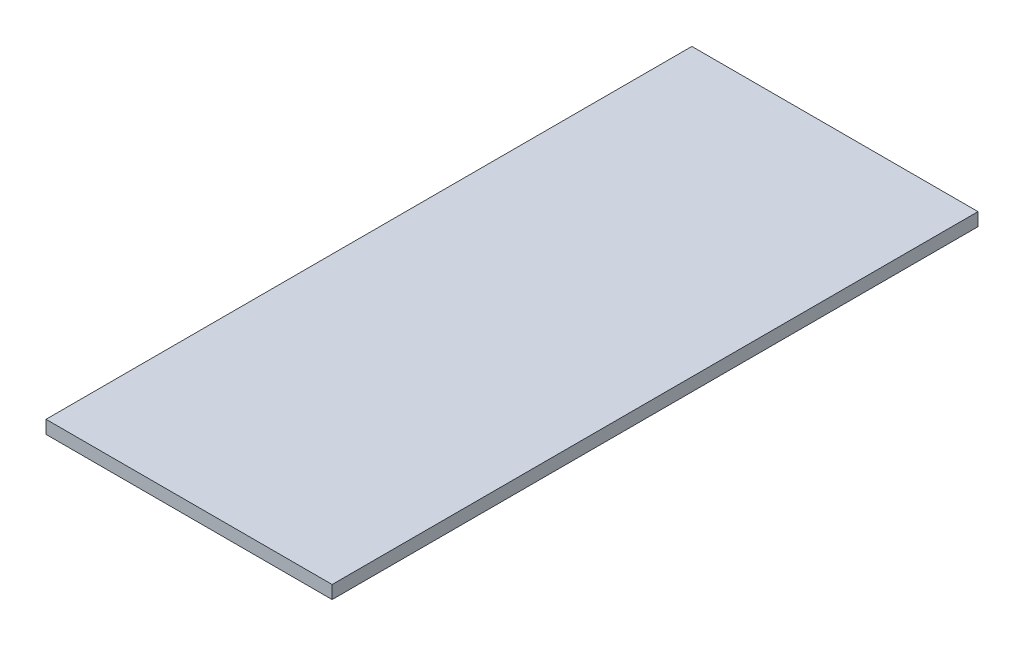
ISO-10303-21;
HEADER;
FILE_DESCRIPTION(('STEP AP214'),'2;1');
FILE_NAME('part.step','',(''),(''),'','','');
FILE_SCHEMA(('AUTOMOTIVE_DESIGN { 1 0 10303 214 1 1 1 1 }'));
ENDSEC;
DATA;
#1=APPLICATION_CONTEXT('core data for automotive mechanical design processes');
#2=APPLICATION_PROTOCOL_DEFINITION('international standard','automotive_design',2000,#1);
#3=PRODUCT_CONTEXT('',#1,'mechanical');
#4=PRODUCT('Part','Part','',(#3));
#5=PRODUCT_RELATED_PRODUCT_CATEGORY('part','',(#4));
#6=PRODUCT_DEFINITION_FORMATION('','',#4);
#7=PRODUCT_DEFINITION_CONTEXT('part definition',#1,'design');
#8=PRODUCT_DEFINITION('design','',#6,#7);
#9=PRODUCT_DEFINITION_SHAPE('','',#8);
#10=(LENGTH_UNIT() NAMED_UNIT(*) SI_UNIT(.MILLI.,.METRE.));
#11=(NAMED_UNIT(*) PLANE_ANGLE_UNIT() SI_UNIT($,.RADIAN.));
#12=(NAMED_UNIT(*) SI_UNIT($,.STERADIAN.) SOLID_ANGLE_UNIT());
#13=UNCERTAINTY_MEASURE_WITH_UNIT(LENGTH_MEASURE(1.E-05),#10,'distance_accuracy_value','');
#14=(GEOMETRIC_REPRESENTATION_CONTEXT(3) GLOBAL_UNCERTAINTY_ASSIGNED_CONTEXT((#13)) GLOBAL_UNIT_ASSIGNED_CONTEXT((#10,
#11,#12)) REPRESENTATION_CONTEXT('',''));
#15=CARTESIAN_POINT('',(0.,0.,0.));
#16=DIRECTION('',(0.,0.,1.));
#17=DIRECTION('',(1.,0.,0.));
#18=AXIS2_PLACEMENT_3D('',#15,#16,#17);
#19=CARTESIAN_POINT('',(2.25000000000002,4.82945135414424,70.8633494652552));
#20=DIRECTION('',(-1.,0.,0.));
#21=DIRECTION('',(0.,-1.,0.));
#22=AXIS2_PLACEMENT_3D('',#19,#20,#21);
#23=PLANE('',#22);
#24=DIRECTION('',(0.,0.,-1.));
#25=VECTOR('',#24,1.);
#26=CARTESIAN_POINT('',(2.25000000000002,4.02945135414424,70.8633494652552));
#27=LINE('',#26,#25);
#28=CARTESIAN_POINT('',(2.25000000000002,4.02945135414424,70.8633494652552));
#29=VERTEX_POINT('',#28);
#30=CARTESIAN_POINT('',(2.25000000000002,4.02945135414423,31.3633494652552));
#31=VERTEX_POINT('',#30);
#32=EDGE_CURVE('E102',#29,#31,#27,.T.);
#33=ORIENTED_EDGE('',*,*,#32,.T.);
#34=DIRECTION('',(0.,-1.,0.));
#35=VECTOR('',#34,1.);
#36=CARTESIAN_POINT('',(2.25000000000002,4.82945135414423,31.3633494652552));
#37=LINE('',#36,#35);
#38=CARTESIAN_POINT('',(2.25000000000002,4.82945135414423,31.3633494652552));
#39=VERTEX_POINT('',#38);
#40=EDGE_CURVE('E11',#39,#31,#37,.T.);
#41=ORIENTED_EDGE('',*,*,#40,.F.);
#42=DIRECTION('',(0.,0.,-1.));
#43=VECTOR('',#42,1.);
#44=CARTESIAN_POINT('',(2.25000000000002,4.82945135414424,70.8633494652552));
#45=LINE('',#44,#43);
#46=CARTESIAN_POINT('',(2.25000000000002,4.82945135414424,70.8633494652552));
#47=VERTEX_POINT('',#46);
#48=EDGE_CURVE('E90',#47,#39,#45,.T.);
#49=ORIENTED_EDGE('',*,*,#48,.F.);
#50=DIRECTION('',(0.,-1.,0.));
#51=VECTOR('',#50,1.);
#52=CARTESIAN_POINT('',(2.25000000000002,4.82945135414424,70.8633494652552));
#53=LINE('',#52,#51);
#54=EDGE_CURVE('E98',#47,#29,#53,.T.);
#55=ORIENTED_EDGE('',*,*,#54,.T.);
#56=EDGE_LOOP('',(#33,#41,#49,#55));
#57=FACE_BOUND('',#56,.T.);
#58=ADVANCED_FACE('F39',(#57),#23,.F.);
#59=CARTESIAN_POINT('',(2.25000000000002,4.82945135414423,31.3633494652552));
#60=DIRECTION('',(0.,0.,1.));
#61=DIRECTION('',(0.,-1.,0.));
#62=AXIS2_PLACEMENT_3D('',#59,#60,#61);
#63=PLANE('',#62);
#64=DIRECTION('',(-1.,0.,0.));
#65=VECTOR('',#64,1.);
#66=CARTESIAN_POINT('',(2.25000000000002,4.02945135414423,31.3633494652552));
#67=LINE('',#66,#65);
#68=CARTESIAN_POINT('',(-15.25,4.02945135414423,31.3633494652552));
#69=VERTEX_POINT('',#68);
#70=EDGE_CURVE('E94',#31,#69,#67,.T.);
#71=ORIENTED_EDGE('',*,*,#70,.T.);
#72=DIRECTION('',(0.,-1.,0.));
#73=VECTOR('',#72,1.);
#74=CARTESIAN_POINT('',(-15.25,4.82945135414423,31.3633494652552));
#75=LINE('',#74,#73);
#76=CARTESIAN_POINT('',(-15.25,4.82945135414423,31.3633494652552));
#77=VERTEX_POINT('',#76);
#78=EDGE_CURVE('E47',#77,#69,#75,.T.);
#79=ORIENTED_EDGE('',*,*,#78,.F.);
#80=DIRECTION('',(-1.,0.,0.));
#81=VECTOR('',#80,1.);
#82=CARTESIAN_POINT('',(2.25000000000002,4.82945135414423,31.3633494652552));
#83=LINE('',#82,#81);
#84=EDGE_CURVE('E85',#39,#77,#83,.T.);
#85=ORIENTED_EDGE('',*,*,#84,.F.);
#86=ORIENTED_EDGE('',*,*,#40,.T.);
#87=EDGE_LOOP('',(#71,#79,#85,#86));
#88=FACE_BOUND('',#87,.T.);
#89=ADVANCED_FACE('F93',(#88),#63,.F.);
#90=CARTESIAN_POINT('',(-15.25,4.82945135414424,70.8633494652552));
#91=DIRECTION('',(1.,0.,0.));
#92=DIRECTION('',(0.,1.,0.));
#93=AXIS2_PLACEMENT_3D('',#90,#91,#92);
#94=PLANE('',#93);
#95=DIRECTION('',(0.,0.,1.));
#96=VECTOR('',#95,1.);
#97=CARTESIAN_POINT('',(-15.25,4.02945135414424,70.8633494652552));
#98=LINE('',#97,#96);
#99=CARTESIAN_POINT('',(-15.25,4.02945135414424,70.8633494652552));
#100=VERTEX_POINT('',#99);
#101=EDGE_CURVE('E72',#69,#100,#98,.T.);
#102=ORIENTED_EDGE('',*,*,#101,.T.);
#103=DIRECTION('',(0.,-1.,0.));
#104=VECTOR('',#103,1.);
#105=CARTESIAN_POINT('',(-15.25,4.82945135414424,70.8633494652552));
#106=LINE('',#105,#104);
#107=CARTESIAN_POINT('',(-15.25,4.82945135414424,70.8633494652552));
#108=VERTEX_POINT('',#107);
#109=EDGE_CURVE('E95',#108,#100,#106,.T.);
#110=ORIENTED_EDGE('',*,*,#109,.F.);
#111=DIRECTION('',(0.,0.,1.));
#112=VECTOR('',#111,1.);
#113=CARTESIAN_POINT('',(-15.25,4.82945135414424,70.8633494652552));
#114=LINE('',#113,#112);
#115=EDGE_CURVE('E88',#77,#108,#114,.T.);
#116=ORIENTED_EDGE('',*,*,#115,.F.);
#117=ORIENTED_EDGE('',*,*,#78,.T.);
#118=EDGE_LOOP('',(#102,#110,#116,#117));
#119=FACE_BOUND('',#118,.T.);
#120=ADVANCED_FACE('F96',(#119),#94,.F.);
#121=CARTESIAN_POINT('',(2.25000000000002,4.82945135414424,70.8633494652552));
#122=DIRECTION('',(0.,0.,-1.));
#123=DIRECTION('',(0.,1.,0.));
#124=AXIS2_PLACEMENT_3D('',#121,#122,#123);
#125=PLANE('',#124);
#126=DIRECTION('',(1.,0.,0.));
#127=VECTOR('',#126,1.);
#128=CARTESIAN_POINT('',(2.25000000000002,4.02945135414424,70.8633494652552));
#129=LINE('',#128,#127);
#130=EDGE_CURVE('E78',#100,#29,#129,.T.);
#131=ORIENTED_EDGE('',*,*,#130,.T.);
#132=ORIENTED_EDGE('',*,*,#54,.F.);
#133=DIRECTION('',(1.,0.,0.));
#134=VECTOR('',#133,1.);
#135=CARTESIAN_POINT('',(2.25000000000002,4.82945135414424,70.8633494652552));
#136=LINE('',#135,#134);
#137=EDGE_CURVE('E55',#108,#47,#136,.T.);
#138=ORIENTED_EDGE('',*,*,#137,.F.);
#139=ORIENTED_EDGE('',*,*,#109,.T.);
#140=EDGE_LOOP('',(#131,#132,#138,#139));
#141=FACE_BOUND('',#140,.T.);
#142=ADVANCED_FACE('F109',(#141),#125,.F.);
#143=CARTESIAN_POINT('',(0.,4.82945135414422,0.));
#144=DIRECTION('',(0.,1.,0.));
#145=DIRECTION('',(0.,0.,1.));
#146=AXIS2_PLACEMENT_3D('',#143,#144,#145);
#147=PLANE('',#146);
#148=ORIENTED_EDGE('',*,*,#48,.T.);
#149=ORIENTED_EDGE('',*,*,#84,.T.);
#150=ORIENTED_EDGE('',*,*,#115,.T.);
#151=ORIENTED_EDGE('',*,*,#137,.T.);
#152=EDGE_LOOP('',(#148,#149,#150,#151));
#153=FACE_BOUND('',#152,.T.);
#154=ADVANCED_FACE('F86',(#153),#147,.T.);
#155=CARTESIAN_POINT('',(0.,4.02945135414422,0.));
#156=DIRECTION('',(0.,1.,0.));
#157=DIRECTION('',(0.,0.,1.));
#158=AXIS2_PLACEMENT_3D('',#155,#156,#157);
#159=PLANE('',#158);
#160=ORIENTED_EDGE('',*,*,#32,.F.);
#161=ORIENTED_EDGE('',*,*,#130,.F.);
#162=ORIENTED_EDGE('',*,*,#101,.F.);
#163=ORIENTED_EDGE('',*,*,#70,.F.);
#164=EDGE_LOOP('',(#160,#161,#162,#163));
#165=FACE_BOUND('',#164,.T.);
#166=ADVANCED_FACE('F112',(#165),#159,.F.);
#167=CLOSED_SHELL('',(#58,#89,#120,#142,#154,#166));
#168=MANIFOLD_SOLID_BREP('B2',#167);
#169=ADVANCED_BREP_SHAPE_REPRESENTATION('',(#18,#168),#14);
#170=SHAPE_DEFINITION_REPRESENTATION(#9,#169);
ENDSEC;
END-ISO-10303-21;
